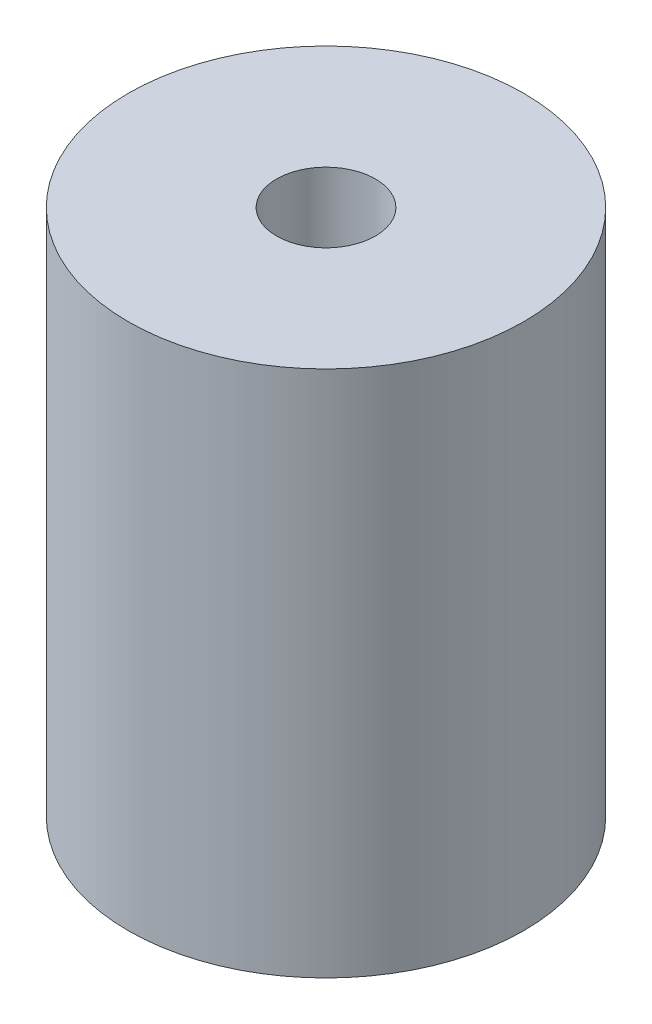
ISO-10303-21;
HEADER;
FILE_DESCRIPTION(('STEP AP214'),'2;1');
FILE_NAME('part.step','',(''),(''),'','','');
FILE_SCHEMA(('AUTOMOTIVE_DESIGN { 1 0 10303 214 1 1 1 1 }'));
ENDSEC;
DATA;
#1=APPLICATION_CONTEXT('core data for automotive mechanical design processes');
#2=APPLICATION_PROTOCOL_DEFINITION('international standard','automotive_design',2000,#1);
#3=PRODUCT_CONTEXT('',#1,'mechanical');
#4=PRODUCT('Part','Part','',(#3));
#5=PRODUCT_RELATED_PRODUCT_CATEGORY('part','',(#4));
#6=PRODUCT_DEFINITION_FORMATION('','',#4);
#7=PRODUCT_DEFINITION_CONTEXT('part definition',#1,'design');
#8=PRODUCT_DEFINITION('design','',#6,#7);
#9=PRODUCT_DEFINITION_SHAPE('','',#8);
#10=(LENGTH_UNIT() NAMED_UNIT(*) SI_UNIT(.MILLI.,.METRE.));
#11=(NAMED_UNIT(*) PLANE_ANGLE_UNIT() SI_UNIT($,.RADIAN.));
#12=(NAMED_UNIT(*) SI_UNIT($,.STERADIAN.) SOLID_ANGLE_UNIT());
#13=UNCERTAINTY_MEASURE_WITH_UNIT(LENGTH_MEASURE(1.E-05),#10,'distance_accuracy_value','');
#14=(GEOMETRIC_REPRESENTATION_CONTEXT(3) GLOBAL_UNCERTAINTY_ASSIGNED_CONTEXT((#13)) GLOBAL_UNIT_ASSIGNED_CONTEXT((#10,
#11,#12)) REPRESENTATION_CONTEXT('',''));
#15=CARTESIAN_POINT('',(0.,0.,0.));
#16=DIRECTION('',(0.,0.,1.));
#17=DIRECTION('',(1.,0.,0.));
#18=AXIS2_PLACEMENT_3D('',#15,#16,#17);
#19=CARTESIAN_POINT('',(0.,16.,0.));
#20=DIRECTION('',(0.,1.,0.));
#21=DIRECTION('',(0.,0.,1.));
#22=AXIS2_PLACEMENT_3D('',#19,#20,#21);
#23=PLANE('',#22);
#24=CARTESIAN_POINT('',(0.,16.,0.));
#25=DIRECTION('',(0.,1.,0.));
#26=DIRECTION('',(0.,0.,1.));
#27=AXIS2_PLACEMENT_3D('',#24,#25,#26);
#28=CIRCLE('',#27,12.);
#29=CARTESIAN_POINT('',(0.,16.,12.));
#30=VERTEX_POINT('',#29);
#31=EDGE_CURVE('E10',#30,#30,#28,.T.);
#32=ORIENTED_EDGE('',*,*,#31,.T.);
#33=EDGE_LOOP('',(#32));
#34=FACE_BOUND('',#33,.T.);
#35=CARTESIAN_POINT('',(0.,16.,0.));
#36=DIRECTION('',(0.,1.,0.));
#37=DIRECTION('',(0.,0.,1.));
#38=AXIS2_PLACEMENT_3D('',#35,#36,#37);
#39=CIRCLE('',#38,3.);
#40=CARTESIAN_POINT('',(0.,16.,3.));
#41=VERTEX_POINT('',#40);
#42=EDGE_CURVE('E44',#41,#41,#39,.T.);
#43=ORIENTED_EDGE('',*,*,#42,.F.);
#44=EDGE_LOOP('',(#43));
#45=FACE_BOUND('',#44,.T.);
#46=ADVANCED_FACE('F33',(#34,#45),#23,.T.);
#47=CARTESIAN_POINT('',(0.,-16.,0.));
#48=DIRECTION('',(0.,1.,0.));
#49=DIRECTION('',(0.,0.,1.));
#50=AXIS2_PLACEMENT_3D('',#47,#48,#49);
#51=PLANE('',#50);
#52=CARTESIAN_POINT('',(0.,-16.,0.));
#53=DIRECTION('',(0.,1.,0.));
#54=DIRECTION('',(0.,0.,1.));
#55=AXIS2_PLACEMENT_3D('',#52,#53,#54);
#56=CIRCLE('',#55,12.);
#57=CARTESIAN_POINT('',(0.,-16.,12.));
#58=VERTEX_POINT('',#57);
#59=EDGE_CURVE('E37',#58,#58,#56,.T.);
#60=ORIENTED_EDGE('',*,*,#59,.F.);
#61=EDGE_LOOP('',(#60));
#62=FACE_BOUND('',#61,.T.);
#63=CARTESIAN_POINT('',(0.,-16.,0.));
#64=DIRECTION('',(0.,1.,0.));
#65=DIRECTION('',(0.,0.,1.));
#66=AXIS2_PLACEMENT_3D('',#63,#64,#65);
#67=CIRCLE('',#66,3.);
#68=CARTESIAN_POINT('',(0.,-16.,3.));
#69=VERTEX_POINT('',#68);
#70=EDGE_CURVE('E46',#69,#69,#67,.T.);
#71=ORIENTED_EDGE('',*,*,#70,.T.);
#72=EDGE_LOOP('',(#71));
#73=FACE_BOUND('',#72,.T.);
#74=ADVANCED_FACE('F56',(#62,#73),#51,.F.);
#75=CARTESIAN_POINT('',(0.,16.,0.));
#76=DIRECTION('',(0.,-1.,0.));
#77=DIRECTION('',(0.,0.,-1.));
#78=AXIS2_PLACEMENT_3D('',#75,#76,#77);
#79=CYLINDRICAL_SURFACE('',#78,12.);
#80=ORIENTED_EDGE('',*,*,#31,.F.);
#81=EDGE_LOOP('',(#80));
#82=FACE_BOUND('',#81,.T.);
#83=ORIENTED_EDGE('',*,*,#59,.T.);
#84=EDGE_LOOP('',(#83));
#85=FACE_BOUND('',#84,.T.);
#86=ADVANCED_FACE('F35',(#82,#85),#79,.T.);
#87=CARTESIAN_POINT('',(0.,16.,0.));
#88=DIRECTION('',(0.,-1.,0.));
#89=DIRECTION('',(0.,0.,-1.));
#90=AXIS2_PLACEMENT_3D('',#87,#88,#89);
#91=CYLINDRICAL_SURFACE('',#90,3.);
#92=ORIENTED_EDGE('',*,*,#42,.T.);
#93=EDGE_LOOP('',(#92));
#94=FACE_BOUND('',#93,.T.);
#95=ORIENTED_EDGE('',*,*,#70,.F.);
#96=EDGE_LOOP('',(#95));
#97=FACE_BOUND('',#96,.T.);
#98=ADVANCED_FACE('F52',(#94,#97),#91,.F.);
#99=CLOSED_SHELL('',(#46,#74,#86,#98));
#100=MANIFOLD_SOLID_BREP('B2',#99);
#101=ADVANCED_BREP_SHAPE_REPRESENTATION('',(#18,#100),#14);
#102=SHAPE_DEFINITION_REPRESENTATION(#9,#101);
ENDSEC;
END-ISO-10303-21;
